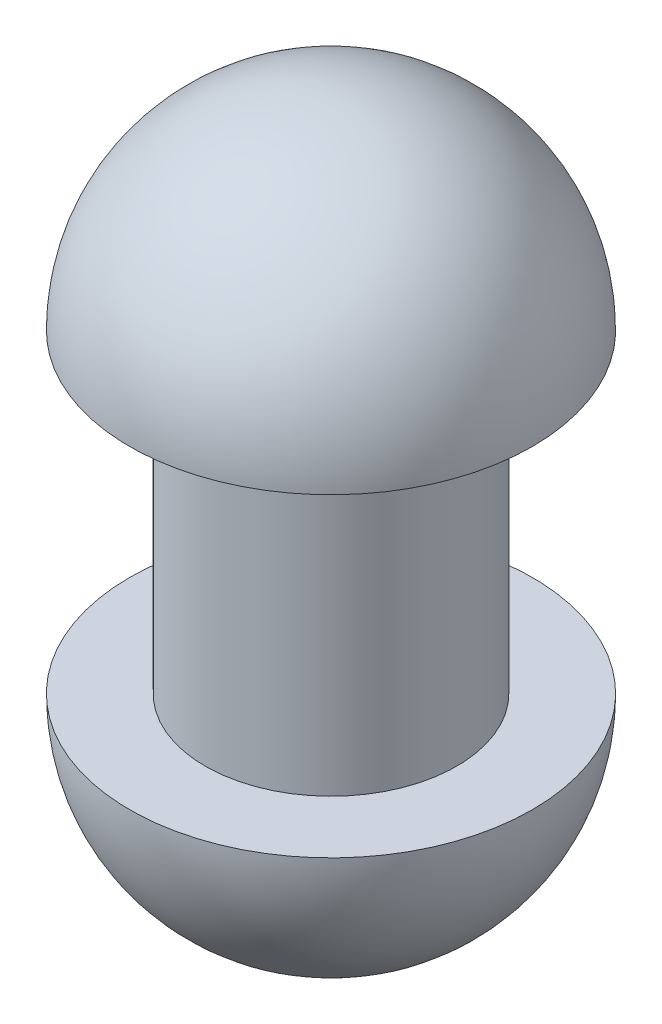
ISO-10303-21;
HEADER;
FILE_DESCRIPTION(('STEP AP214'),'2;1');
FILE_NAME('part.step','',(''),(''),'','','');
FILE_SCHEMA(('AUTOMOTIVE_DESIGN { 1 0 10303 214 1 1 1 1 }'));
ENDSEC;
DATA;
#1=APPLICATION_CONTEXT('core data for automotive mechanical design processes');
#2=APPLICATION_PROTOCOL_DEFINITION('international standard','automotive_design',2000,#1);
#3=PRODUCT_CONTEXT('',#1,'mechanical');
#4=PRODUCT('Part','Part','',(#3));
#5=PRODUCT_RELATED_PRODUCT_CATEGORY('part','',(#4));
#6=PRODUCT_DEFINITION_FORMATION('','',#4);
#7=PRODUCT_DEFINITION_CONTEXT('part definition',#1,'design');
#8=PRODUCT_DEFINITION('design','',#6,#7);
#9=PRODUCT_DEFINITION_SHAPE('','',#8);
#10=(LENGTH_UNIT() NAMED_UNIT(*) SI_UNIT(.MILLI.,.METRE.));
#11=(NAMED_UNIT(*) PLANE_ANGLE_UNIT() SI_UNIT($,.RADIAN.));
#12=(NAMED_UNIT(*) SI_UNIT($,.STERADIAN.) SOLID_ANGLE_UNIT());
#13=UNCERTAINTY_MEASURE_WITH_UNIT(LENGTH_MEASURE(1.E-05),#10,'distance_accuracy_value','');
#14=(GEOMETRIC_REPRESENTATION_CONTEXT(3) GLOBAL_UNCERTAINTY_ASSIGNED_CONTEXT((#13)) GLOBAL_UNIT_ASSIGNED_CONTEXT((#10,
#11,#12)) REPRESENTATION_CONTEXT('',''));
#15=CARTESIAN_POINT('',(0.,0.,0.));
#16=DIRECTION('',(0.,0.,1.));
#17=DIRECTION('',(1.,0.,0.));
#18=AXIS2_PLACEMENT_3D('',#15,#16,#17);
#19=CARTESIAN_POINT('',(6.77395286132676,18.734693877551,0.));
#20=DIRECTION('',(0.,1.,0.));
#21=DIRECTION('',(-1.,0.,0.));
#22=AXIS2_PLACEMENT_3D('',#19,#20,#21);
#23=PLANE('',#22);
#24=CARTESIAN_POINT('',(-2.22604713867323,18.734693877551,0.));
#25=DIRECTION('',(0.,1.,0.));
#26=DIRECTION('',(-1.,0.,0.));
#27=AXIS2_PLACEMENT_3D('',#24,#25,#26);
#28=CIRCLE('',#27,14.4);
#29=CARTESIAN_POINT('',(-16.6260471386732,18.734693877551,0.));
#30=VERTEX_POINT('',#29);
#31=EDGE_CURVE('E10',#30,#30,#28,.T.);
#32=ORIENTED_EDGE('',*,*,#31,.F.);
#33=EDGE_LOOP('',(#32));
#34=FACE_BOUND('',#33,.T.);
#35=CARTESIAN_POINT('',(-2.22604713867323,18.734693877551,0.));
#36=DIRECTION('',(0.,1.,0.));
#37=DIRECTION('',(-1.,0.,0.));
#38=AXIS2_PLACEMENT_3D('',#35,#36,#37);
#39=CIRCLE('',#38,8.99999999999999);
#40=CARTESIAN_POINT('',(-11.2260471386732,18.734693877551,0.));
#41=VERTEX_POINT('',#40);
#42=EDGE_CURVE('E60',#41,#41,#39,.T.);
#43=ORIENTED_EDGE('',*,*,#42,.T.);
#44=EDGE_LOOP('',(#43));
#45=FACE_BOUND('',#44,.T.);
#46=ADVANCED_FACE('F43',(#34,#45),#23,.F.);
#47=CARTESIAN_POINT('',(-2.22604713867323,18.734693877551,0.));
#48=DIRECTION('',(0.,1.,0.));
#49=DIRECTION('',(1.,0.,0.));
#50=AXIS2_PLACEMENT_3D('',#47,#48,#49);
#51=SPHERICAL_SURFACE('',#50,14.4);
#52=ORIENTED_EDGE('',*,*,#31,.T.);
#53=EDGE_LOOP('',(#52));
#54=FACE_BOUND('',#53,.T.);
#55=ADVANCED_FACE('F81',(#54),#51,.T.);
#56=CARTESIAN_POINT('',(-2.22604713867323,-3.76530612244898,0.));
#57=DIRECTION('',(0.,1.,0.));
#58=DIRECTION('',(1.,0.,0.));
#59=AXIS2_PLACEMENT_3D('',#56,#57,#58);
#60=SPHERICAL_SURFACE('',#59,14.4);
#61=CARTESIAN_POINT('',(-2.22604713867322,-3.76530612244898,0.));
#62=DIRECTION('',(0.,1.,0.));
#63=DIRECTION('',(-1.,0.,0.));
#64=AXIS2_PLACEMENT_3D('',#61,#62,#63);
#65=CIRCLE('',#64,14.4);
#66=CARTESIAN_POINT('',(-16.6260471386732,-3.76530612244899,0.));
#67=VERTEX_POINT('',#66);
#68=EDGE_CURVE('E50',#67,#67,#65,.T.);
#69=ORIENTED_EDGE('',*,*,#68,.F.);
#70=EDGE_LOOP('',(#69));
#71=FACE_BOUND('',#70,.T.);
#72=ADVANCED_FACE('F76',(#71),#60,.T.);
#73=CARTESIAN_POINT('',(6.77395286132677,-3.76530612244898,0.));
#74=DIRECTION('',(0.,-1.,0.));
#75=DIRECTION('',(1.,0.,0.));
#76=AXIS2_PLACEMENT_3D('',#73,#74,#75);
#77=PLANE('',#76);
#78=CARTESIAN_POINT('',(-2.22604713867322,-3.76530612244898,0.));
#79=DIRECTION('',(0.,1.,0.));
#80=DIRECTION('',(-1.,0.,0.));
#81=AXIS2_PLACEMENT_3D('',#78,#79,#80);
#82=CIRCLE('',#81,8.99999999999999);
#83=CARTESIAN_POINT('',(-11.2260471386732,-3.76530612244898,0.));
#84=VERTEX_POINT('',#83);
#85=EDGE_CURVE('E55',#84,#84,#82,.T.);
#86=ORIENTED_EDGE('',*,*,#85,.F.);
#87=EDGE_LOOP('',(#86));
#88=FACE_BOUND('',#87,.T.);
#89=ORIENTED_EDGE('',*,*,#68,.T.);
#90=EDGE_LOOP('',(#89));
#91=FACE_BOUND('',#90,.T.);
#92=ADVANCED_FACE('F71',(#88,#91),#77,.F.);
#93=CARTESIAN_POINT('',(-2.22604713867323,33.134693877551,0.));
#94=DIRECTION('',(0.,1.,0.));
#95=DIRECTION('',(-1.,0.,0.));
#96=AXIS2_PLACEMENT_3D('',#93,#94,#95);
#97=CYLINDRICAL_SURFACE('',#96,8.99999999999999);
#98=ORIENTED_EDGE('',*,*,#42,.F.);
#99=EDGE_LOOP('',(#98));
#100=FACE_BOUND('',#99,.T.);
#101=ORIENTED_EDGE('',*,*,#85,.T.);
#102=EDGE_LOOP('',(#101));
#103=FACE_BOUND('',#102,.T.);
#104=ADVANCED_FACE('F68',(#100,#103),#97,.T.);
#105=CLOSED_SHELL('',(#46,#55,#72,#92,#104));
#106=MANIFOLD_SOLID_BREP('B2',#105);
#107=ADVANCED_BREP_SHAPE_REPRESENTATION('',(#18,#106),#14);
#108=SHAPE_DEFINITION_REPRESENTATION(#9,#107);
ENDSEC;
END-ISO-10303-21;
